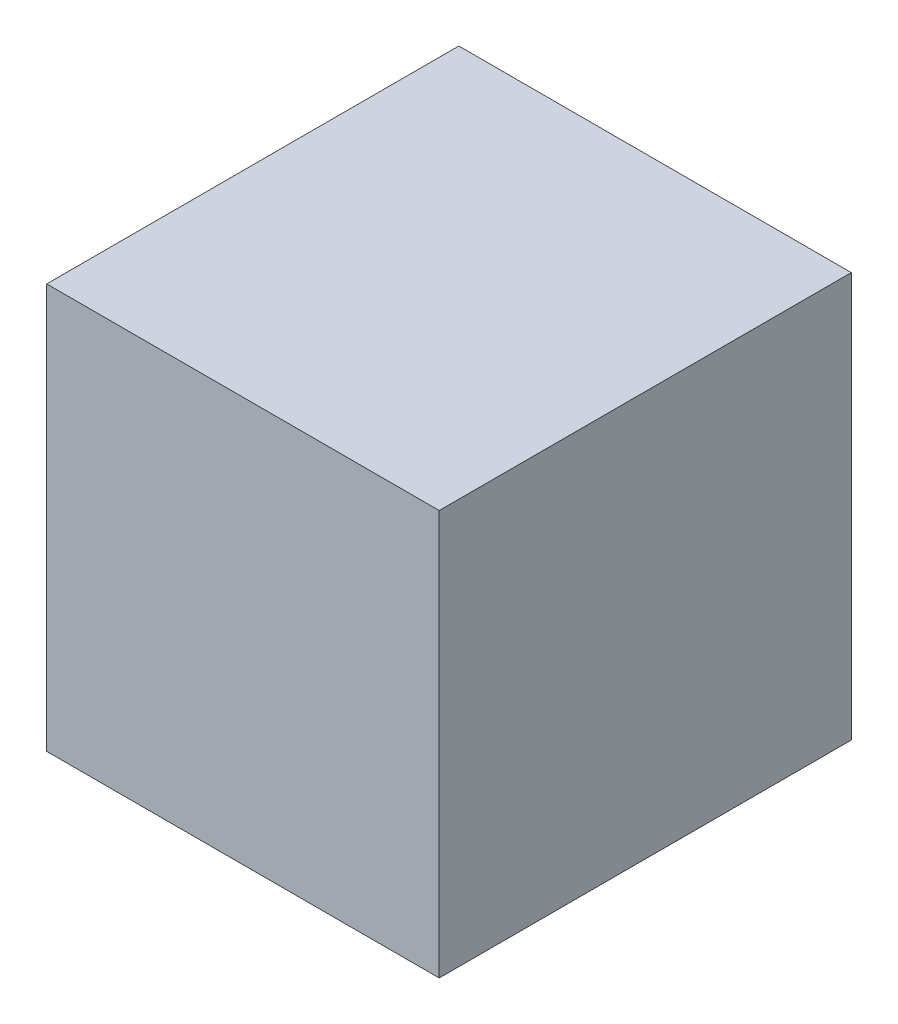
ISO-10303-21;
HEADER;
FILE_DESCRIPTION(('STEP AP214'),'2;1');
FILE_NAME('part.step','',(''),(''),'','','');
FILE_SCHEMA(('AUTOMOTIVE_DESIGN { 1 0 10303 214 1 1 1 1 }'));
ENDSEC;
DATA;
#1=APPLICATION_CONTEXT('core data for automotive mechanical design processes');
#2=APPLICATION_PROTOCOL_DEFINITION('international standard','automotive_design',2000,#1);
#3=PRODUCT_CONTEXT('',#1,'mechanical');
#4=PRODUCT('Part','Part','',(#3));
#5=PRODUCT_RELATED_PRODUCT_CATEGORY('part','',(#4));
#6=PRODUCT_DEFINITION_FORMATION('','',#4);
#7=PRODUCT_DEFINITION_CONTEXT('part definition',#1,'design');
#8=PRODUCT_DEFINITION('design','',#6,#7);
#9=PRODUCT_DEFINITION_SHAPE('','',#8);
#10=(LENGTH_UNIT() NAMED_UNIT(*) SI_UNIT(.MILLI.,.METRE.));
#11=(NAMED_UNIT(*) PLANE_ANGLE_UNIT() SI_UNIT($,.RADIAN.));
#12=(NAMED_UNIT(*) SI_UNIT($,.STERADIAN.) SOLID_ANGLE_UNIT());
#13=UNCERTAINTY_MEASURE_WITH_UNIT(LENGTH_MEASURE(1.E-05),#10,'distance_accuracy_value','');
#14=(GEOMETRIC_REPRESENTATION_CONTEXT(3) GLOBAL_UNCERTAINTY_ASSIGNED_CONTEXT((#13)) GLOBAL_UNIT_ASSIGNED_CONTEXT((#10,
#11,#12)) REPRESENTATION_CONTEXT('',''));
#15=CARTESIAN_POINT('',(0.,0.,0.));
#16=DIRECTION('',(0.,0.,1.));
#17=DIRECTION('',(1.,0.,0.));
#18=AXIS2_PLACEMENT_3D('',#15,#16,#17);
#19=CARTESIAN_POINT('',(0.,-29.6653277972811,40.));
#20=DIRECTION('',(0.,1.,0.));
#21=DIRECTION('',(-1.,0.,0.));
#22=AXIS2_PLACEMENT_3D('',#19,#20,#21);
#23=PLANE('',#22);
#24=DIRECTION('',(1.,0.,0.));
#25=VECTOR('',#24,1.);
#26=CARTESIAN_POINT('',(0.,-29.6653277972811,0.));
#27=LINE('',#26,#25);
#28=CARTESIAN_POINT('',(-9.03314366632912,-29.6653277972811,0.));
#29=VERTEX_POINT('',#28);
#30=CARTESIAN_POINT('',(29.0662585842205,-29.6653277972811,0.));
#31=VERTEX_POINT('',#30);
#32=EDGE_CURVE('E97',#29,#31,#27,.T.);
#33=ORIENTED_EDGE('',*,*,#32,.T.);
#34=DIRECTION('',(0.,0.,-1.));
#35=VECTOR('',#34,1.);
#36=CARTESIAN_POINT('',(29.0662585842205,-29.6653277972811,40.));
#37=LINE('',#36,#35);
#38=CARTESIAN_POINT('',(29.0662585842205,-29.6653277972811,40.));
#39=VERTEX_POINT('',#38);
#40=EDGE_CURVE('E11',#39,#31,#37,.T.);
#41=ORIENTED_EDGE('',*,*,#40,.F.);
#42=DIRECTION('',(1.,0.,0.));
#43=VECTOR('',#42,1.);
#44=CARTESIAN_POINT('',(0.,-29.6653277972811,40.));
#45=LINE('',#44,#43);
#46=CARTESIAN_POINT('',(-9.03314366632912,-29.6653277972811,40.));
#47=VERTEX_POINT('',#46);
#48=EDGE_CURVE('E83',#47,#39,#45,.T.);
#49=ORIENTED_EDGE('',*,*,#48,.F.);
#50=DIRECTION('',(0.,0.,-1.));
#51=VECTOR('',#50,1.);
#52=CARTESIAN_POINT('',(-9.03314366632912,-29.6653277972811,40.));
#53=LINE('',#52,#51);
#54=EDGE_CURVE('E50',#47,#29,#53,.T.);
#55=ORIENTED_EDGE('',*,*,#54,.T.);
#56=EDGE_LOOP('',(#33,#41,#49,#55));
#57=FACE_BOUND('',#56,.T.);
#58=ADVANCED_FACE('F34',(#57),#23,.F.);
#59=CARTESIAN_POINT('',(29.0662585842205,0.,40.));
#60=DIRECTION('',(-1.,0.,0.));
#61=DIRECTION('',(0.,0.,1.));
#62=AXIS2_PLACEMENT_3D('',#59,#60,#61);
#63=PLANE('',#62);
#64=DIRECTION('',(0.,1.,0.));
#65=VECTOR('',#64,1.);
#66=CARTESIAN_POINT('',(29.0662585842205,0.,0.));
#67=LINE('',#66,#65);
#68=CARTESIAN_POINT('',(29.0662585842205,9.63221287938977,0.));
#69=VERTEX_POINT('',#68);
#70=EDGE_CURVE('E88',#31,#69,#67,.T.);
#71=ORIENTED_EDGE('',*,*,#70,.T.);
#72=DIRECTION('',(0.,0.,-1.));
#73=VECTOR('',#72,1.);
#74=CARTESIAN_POINT('',(29.0662585842205,9.63221287938977,40.));
#75=LINE('',#74,#73);
#76=CARTESIAN_POINT('',(29.0662585842205,9.63221287938977,40.));
#77=VERTEX_POINT('',#76);
#78=EDGE_CURVE('E42',#77,#69,#75,.T.);
#79=ORIENTED_EDGE('',*,*,#78,.F.);
#80=DIRECTION('',(0.,1.,0.));
#81=VECTOR('',#80,1.);
#82=CARTESIAN_POINT('',(29.0662585842205,0.,40.));
#83=LINE('',#82,#81);
#84=EDGE_CURVE('E75',#39,#77,#83,.T.);
#85=ORIENTED_EDGE('',*,*,#84,.F.);
#86=ORIENTED_EDGE('',*,*,#40,.T.);
#87=EDGE_LOOP('',(#71,#79,#85,#86));
#88=FACE_BOUND('',#87,.T.);
#89=ADVANCED_FACE('F87',(#88),#63,.F.);
#90=CARTESIAN_POINT('',(0.,9.63221287938977,40.));
#91=DIRECTION('',(0.,1.,0.));
#92=DIRECTION('',(-1.,0.,0.));
#93=AXIS2_PLACEMENT_3D('',#90,#91,#92);
#94=PLANE('',#93);
#95=DIRECTION('',(1.,0.,0.));
#96=VECTOR('',#95,1.);
#97=CARTESIAN_POINT('',(0.,9.63221287938977,0.));
#98=LINE('',#97,#96);
#99=CARTESIAN_POINT('',(-9.03314366632913,9.63221287938977,0.));
#100=VERTEX_POINT('',#99);
#101=EDGE_CURVE('E101',#100,#69,#98,.T.);
#102=ORIENTED_EDGE('',*,*,#101,.F.);
#103=DIRECTION('',(0.,0.,-1.));
#104=VECTOR('',#103,1.);
#105=CARTESIAN_POINT('',(-9.03314366632913,9.63221287938977,40.));
#106=LINE('',#105,#104);
#107=CARTESIAN_POINT('',(-9.03314366632913,9.63221287938977,40.));
#108=VERTEX_POINT('',#107);
#109=EDGE_CURVE('E64',#108,#100,#106,.T.);
#110=ORIENTED_EDGE('',*,*,#109,.F.);
#111=DIRECTION('',(1.,0.,0.));
#112=VECTOR('',#111,1.);
#113=CARTESIAN_POINT('',(0.,9.63221287938977,40.));
#114=LINE('',#113,#112);
#115=EDGE_CURVE('E82',#108,#77,#114,.T.);
#116=ORIENTED_EDGE('',*,*,#115,.T.);
#117=ORIENTED_EDGE('',*,*,#78,.T.);
#118=EDGE_LOOP('',(#102,#110,#116,#117));
#119=FACE_BOUND('',#118,.T.);
#120=ADVANCED_FACE('F91',(#119),#94,.T.);
#121=CARTESIAN_POINT('',(-9.03314366632913,0.,40.));
#122=DIRECTION('',(-1.,0.,0.));
#123=DIRECTION('',(0.,-1.,0.));
#124=AXIS2_PLACEMENT_3D('',#121,#122,#123);
#125=PLANE('',#124);
#126=DIRECTION('',(0.,1.,0.));
#127=VECTOR('',#126,1.);
#128=CARTESIAN_POINT('',(-9.03314366632913,0.,0.));
#129=LINE('',#128,#127);
#130=EDGE_CURVE('E103',#29,#100,#129,.T.);
#131=ORIENTED_EDGE('',*,*,#130,.F.);
#132=ORIENTED_EDGE('',*,*,#54,.F.);
#133=DIRECTION('',(0.,1.,0.));
#134=VECTOR('',#133,1.);
#135=CARTESIAN_POINT('',(-9.03314366632913,0.,40.));
#136=LINE('',#135,#134);
#137=EDGE_CURVE('E92',#47,#108,#136,.T.);
#138=ORIENTED_EDGE('',*,*,#137,.T.);
#139=ORIENTED_EDGE('',*,*,#109,.T.);
#140=EDGE_LOOP('',(#131,#132,#138,#139));
#141=FACE_BOUND('',#140,.T.);
#142=ADVANCED_FACE('F130',(#141),#125,.T.);
#143=CARTESIAN_POINT('',(0.,0.,40.));
#144=DIRECTION('',(0.,0.,1.));
#145=DIRECTION('',(1.,0.,0.));
#146=AXIS2_PLACEMENT_3D('',#143,#144,#145);
#147=PLANE('',#146);
#148=ORIENTED_EDGE('',*,*,#48,.T.);
#149=ORIENTED_EDGE('',*,*,#84,.T.);
#150=ORIENTED_EDGE('',*,*,#115,.F.);
#151=ORIENTED_EDGE('',*,*,#137,.F.);
#152=EDGE_LOOP('',(#148,#149,#150,#151));
#153=FACE_BOUND('',#152,.T.);
#154=ADVANCED_FACE('F79',(#153),#147,.T.);
#155=CARTESIAN_POINT('',(0.,0.,0.));
#156=DIRECTION('',(0.,0.,1.));
#157=DIRECTION('',(1.,0.,0.));
#158=AXIS2_PLACEMENT_3D('',#155,#156,#157);
#159=PLANE('',#158);
#160=CARTESIAN_POINT('',(10.0165574589457,-10.0165574589457,0.));
#161=DIRECTION('',(0.,0.,1.));
#162=DIRECTION('',(1.,0.,0.));
#163=AXIS2_PLACEMENT_3D('',#160,#161,#162);
#164=CIRCLE('',#163,3.79708670005155);
#165=CARTESIAN_POINT('',(13.8136441589972,-10.0165574589457,0.));
#166=VERTEX_POINT('',#165);
#167=EDGE_CURVE('E109',#166,#166,#164,.T.);
#168=ORIENTED_EDGE('',*,*,#167,.T.);
#169=EDGE_LOOP('',(#168));
#170=FACE_BOUND('',#169,.T.);
#171=ORIENTED_EDGE('',*,*,#32,.F.);
#172=ORIENTED_EDGE('',*,*,#130,.T.);
#173=ORIENTED_EDGE('',*,*,#101,.T.);
#174=ORIENTED_EDGE('',*,*,#70,.F.);
#175=EDGE_LOOP('',(#171,#172,#173,#174));
#176=FACE_BOUND('',#175,.T.);
#177=ADVANCED_FACE('F124',(#170,#176),#159,.F.);
#178=CARTESIAN_POINT('',(10.0165574589457,-10.0165574589457,20.));
#179=DIRECTION('',(0.,0.,-1.));
#180=DIRECTION('',(-1.,0.,0.));
#181=AXIS2_PLACEMENT_3D('',#178,#179,#180);
#182=CYLINDRICAL_SURFACE('',#181,3.79708670005155);
#183=CARTESIAN_POINT('',(10.0165574589457,-10.0165574589457,20.));
#184=DIRECTION('',(0.,0.,1.));
#185=DIRECTION('',(1.,0.,0.));
#186=AXIS2_PLACEMENT_3D('',#183,#184,#185);
#187=CIRCLE('',#186,3.79708670005155);
#188=CARTESIAN_POINT('',(13.8136441589972,-10.0165574589457,20.));
#189=VERTEX_POINT('',#188);
#190=EDGE_CURVE('E99',#189,#189,#187,.T.);
#191=ORIENTED_EDGE('',*,*,#190,.T.);
#192=EDGE_LOOP('',(#191));
#193=FACE_BOUND('',#192,.T.);
#194=ORIENTED_EDGE('',*,*,#167,.F.);
#195=EDGE_LOOP('',(#194));
#196=FACE_BOUND('',#195,.T.);
#197=ADVANCED_FACE('F115',(#193,#196),#182,.F.);
#198=CARTESIAN_POINT('',(0.,0.,20.));
#199=DIRECTION('',(0.,0.,1.));
#200=DIRECTION('',(1.,0.,0.));
#201=AXIS2_PLACEMENT_3D('',#198,#199,#200);
#202=PLANE('',#201);
#203=ORIENTED_EDGE('',*,*,#190,.F.);
#204=EDGE_LOOP('',(#203));
#205=FACE_BOUND('',#204,.T.);
#206=ADVANCED_FACE('F118',(#205),#202,.F.);
#207=CLOSED_SHELL('',(#58,#89,#120,#142,#154,#177,#197,#206));
#208=MANIFOLD_SOLID_BREP('B2',#207);
#209=ADVANCED_BREP_SHAPE_REPRESENTATION('',(#18,#208),#14);
#210=SHAPE_DEFINITION_REPRESENTATION(#9,#209);
ENDSEC;
END-ISO-10303-21;
